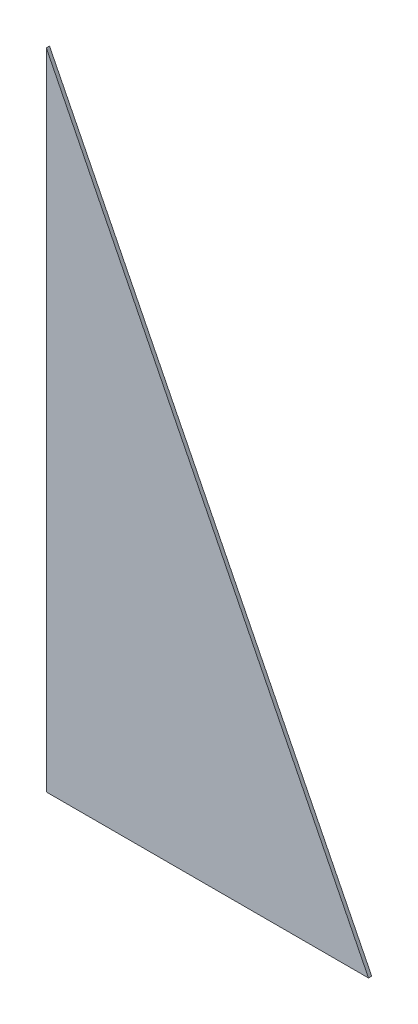
ISO-10303-21;
HEADER;
FILE_DESCRIPTION(('STEP AP214'),'2;1');
FILE_NAME('part.step','',(''),(''),'','','');
FILE_SCHEMA(('AUTOMOTIVE_DESIGN { 1 0 10303 214 1 1 1 1 }'));
ENDSEC;
DATA;
#1=APPLICATION_CONTEXT('core data for automotive mechanical design processes');
#2=APPLICATION_PROTOCOL_DEFINITION('international standard','automotive_design',2000,#1);
#3=PRODUCT_CONTEXT('',#1,'mechanical');
#4=PRODUCT('Part','Part','',(#3));
#5=PRODUCT_RELATED_PRODUCT_CATEGORY('part','',(#4));
#6=PRODUCT_DEFINITION_FORMATION('','',#4);
#7=PRODUCT_DEFINITION_CONTEXT('part definition',#1,'design');
#8=PRODUCT_DEFINITION('design','',#6,#7);
#9=PRODUCT_DEFINITION_SHAPE('','',#8);
#10=(LENGTH_UNIT() NAMED_UNIT(*) SI_UNIT(.MILLI.,.METRE.));
#11=(NAMED_UNIT(*) PLANE_ANGLE_UNIT() SI_UNIT($,.RADIAN.));
#12=(NAMED_UNIT(*) SI_UNIT($,.STERADIAN.) SOLID_ANGLE_UNIT());
#13=UNCERTAINTY_MEASURE_WITH_UNIT(LENGTH_MEASURE(1.E-05),#10,'distance_accuracy_value','');
#14=(GEOMETRIC_REPRESENTATION_CONTEXT(3) GLOBAL_UNCERTAINTY_ASSIGNED_CONTEXT((#13)) GLOBAL_UNIT_ASSIGNED_CONTEXT((#10,
#11,#12)) REPRESENTATION_CONTEXT('',''));
#15=CARTESIAN_POINT('',(0.,0.,0.));
#16=DIRECTION('',(0.,0.,1.));
#17=DIRECTION('',(1.,0.,0.));
#18=AXIS2_PLACEMENT_3D('',#15,#16,#17);
#19=CARTESIAN_POINT('',(0.,2000.,5.));
#20=DIRECTION('',(1.,0.,0.));
#21=DIRECTION('',(0.,0.,-1.));
#22=AXIS2_PLACEMENT_3D('',#19,#20,#21);
#23=PLANE('',#22);
#24=DIRECTION('',(0.,-1.,0.));
#25=VECTOR('',#24,1.);
#26=CARTESIAN_POINT('',(0.,2000.,-5.));
#27=LINE('',#26,#25);
#28=CARTESIAN_POINT('',(0.,2000.,-5.));
#29=VERTEX_POINT('',#28);
#30=CARTESIAN_POINT('',(0.,0.,-5.));
#31=VERTEX_POINT('',#30);
#32=EDGE_CURVE('E84',#29,#31,#27,.T.);
#33=ORIENTED_EDGE('',*,*,#32,.T.);
#34=DIRECTION('',(0.,0.,-1.));
#35=VECTOR('',#34,1.);
#36=CARTESIAN_POINT('',(0.,0.,5.));
#37=LINE('',#36,#35);
#38=CARTESIAN_POINT('',(0.,0.,5.));
#39=VERTEX_POINT('',#38);
#40=EDGE_CURVE('E11',#39,#31,#37,.T.);
#41=ORIENTED_EDGE('',*,*,#40,.F.);
#42=DIRECTION('',(0.,-1.,0.));
#43=VECTOR('',#42,1.);
#44=CARTESIAN_POINT('',(0.,2000.,5.));
#45=LINE('',#44,#43);
#46=CARTESIAN_POINT('',(0.,2000.,5.));
#47=VERTEX_POINT('',#46);
#48=EDGE_CURVE('E77',#47,#39,#45,.T.);
#49=ORIENTED_EDGE('',*,*,#48,.F.);
#50=DIRECTION('',(0.,0.,-1.));
#51=VECTOR('',#50,1.);
#52=CARTESIAN_POINT('',(0.,2000.,5.));
#53=LINE('',#52,#51);
#54=EDGE_CURVE('E85',#47,#29,#53,.T.);
#55=ORIENTED_EDGE('',*,*,#54,.T.);
#56=EDGE_LOOP('',(#33,#41,#49,#55));
#57=FACE_BOUND('',#56,.T.);
#58=ADVANCED_FACE('F37',(#57),#23,.F.);
#59=CARTESIAN_POINT('',(0.,0.,5.));
#60=DIRECTION('',(0.,1.,0.));
#61=DIRECTION('',(0.,0.,1.));
#62=AXIS2_PLACEMENT_3D('',#59,#60,#61);
#63=PLANE('',#62);
#64=DIRECTION('',(1.,0.,0.));
#65=VECTOR('',#64,1.);
#66=CARTESIAN_POINT('',(0.,0.,-5.));
#67=LINE('',#66,#65);
#68=CARTESIAN_POINT('',(1000.,0.,-5.));
#69=VERTEX_POINT('',#68);
#70=EDGE_CURVE('E65',#31,#69,#67,.T.);
#71=ORIENTED_EDGE('',*,*,#70,.T.);
#72=DIRECTION('',(0.,0.,-1.));
#73=VECTOR('',#72,1.);
#74=CARTESIAN_POINT('',(1000.,0.,5.));
#75=LINE('',#74,#73);
#76=CARTESIAN_POINT('',(1000.,0.,5.));
#77=VERTEX_POINT('',#76);
#78=EDGE_CURVE('E45',#77,#69,#75,.T.);
#79=ORIENTED_EDGE('',*,*,#78,.F.);
#80=DIRECTION('',(1.,0.,0.));
#81=VECTOR('',#80,1.);
#82=CARTESIAN_POINT('',(0.,0.,5.));
#83=LINE('',#82,#81);
#84=EDGE_CURVE('E73',#39,#77,#83,.T.);
#85=ORIENTED_EDGE('',*,*,#84,.F.);
#86=ORIENTED_EDGE('',*,*,#40,.T.);
#87=EDGE_LOOP('',(#71,#79,#85,#86));
#88=FACE_BOUND('',#87,.T.);
#89=ADVANCED_FACE('F74',(#88),#63,.F.);
#90=CARTESIAN_POINT('',(1000.,0.,5.));
#91=DIRECTION('',(-0.894427190999916,-0.447213595499958,0.));
#92=DIRECTION('',(0.447213595499958,-0.894427190999916,0.));
#93=AXIS2_PLACEMENT_3D('',#90,#91,#92);
#94=PLANE('',#93);
#95=DIRECTION('',(-0.447213595499958,0.894427190999916,0.));
#96=VECTOR('',#95,1.);
#97=CARTESIAN_POINT('',(1000.,0.,-5.));
#98=LINE('',#97,#96);
#99=EDGE_CURVE('E70',#69,#29,#98,.T.);
#100=ORIENTED_EDGE('',*,*,#99,.T.);
#101=ORIENTED_EDGE('',*,*,#54,.F.);
#102=DIRECTION('',(-0.447213595499958,0.894427190999916,0.));
#103=VECTOR('',#102,1.);
#104=CARTESIAN_POINT('',(1000.,0.,5.));
#105=LINE('',#104,#103);
#106=EDGE_CURVE('E53',#77,#47,#105,.T.);
#107=ORIENTED_EDGE('',*,*,#106,.F.);
#108=ORIENTED_EDGE('',*,*,#78,.T.);
#109=EDGE_LOOP('',(#100,#101,#107,#108));
#110=FACE_BOUND('',#109,.T.);
#111=ADVANCED_FACE('F92',(#110),#94,.F.);
#112=CARTESIAN_POINT('',(0.,0.,5.));
#113=DIRECTION('',(0.,0.,1.));
#114=DIRECTION('',(1.,0.,0.));
#115=AXIS2_PLACEMENT_3D('',#112,#113,#114);
#116=PLANE('',#115);
#117=ORIENTED_EDGE('',*,*,#48,.T.);
#118=ORIENTED_EDGE('',*,*,#84,.T.);
#119=ORIENTED_EDGE('',*,*,#106,.T.);
#120=EDGE_LOOP('',(#117,#118,#119));
#121=FACE_BOUND('',#120,.T.);
#122=ADVANCED_FACE('F80',(#121),#116,.T.);
#123=CARTESIAN_POINT('',(0.,0.,-5.));
#124=DIRECTION('',(0.,0.,1.));
#125=DIRECTION('',(1.,0.,0.));
#126=AXIS2_PLACEMENT_3D('',#123,#124,#125);
#127=PLANE('',#126);
#128=ORIENTED_EDGE('',*,*,#32,.F.);
#129=ORIENTED_EDGE('',*,*,#99,.F.);
#130=ORIENTED_EDGE('',*,*,#70,.F.);
#131=EDGE_LOOP('',(#128,#129,#130));
#132=FACE_BOUND('',#131,.T.);
#133=ADVANCED_FACE('F93',(#132),#127,.F.);
#134=CLOSED_SHELL('',(#58,#89,#111,#122,#133));
#135=MANIFOLD_SOLID_BREP('B2',#134);
#136=ADVANCED_BREP_SHAPE_REPRESENTATION('',(#18,#135),#14);
#137=SHAPE_DEFINITION_REPRESENTATION(#9,#136);
ENDSEC;
END-ISO-10303-21;
